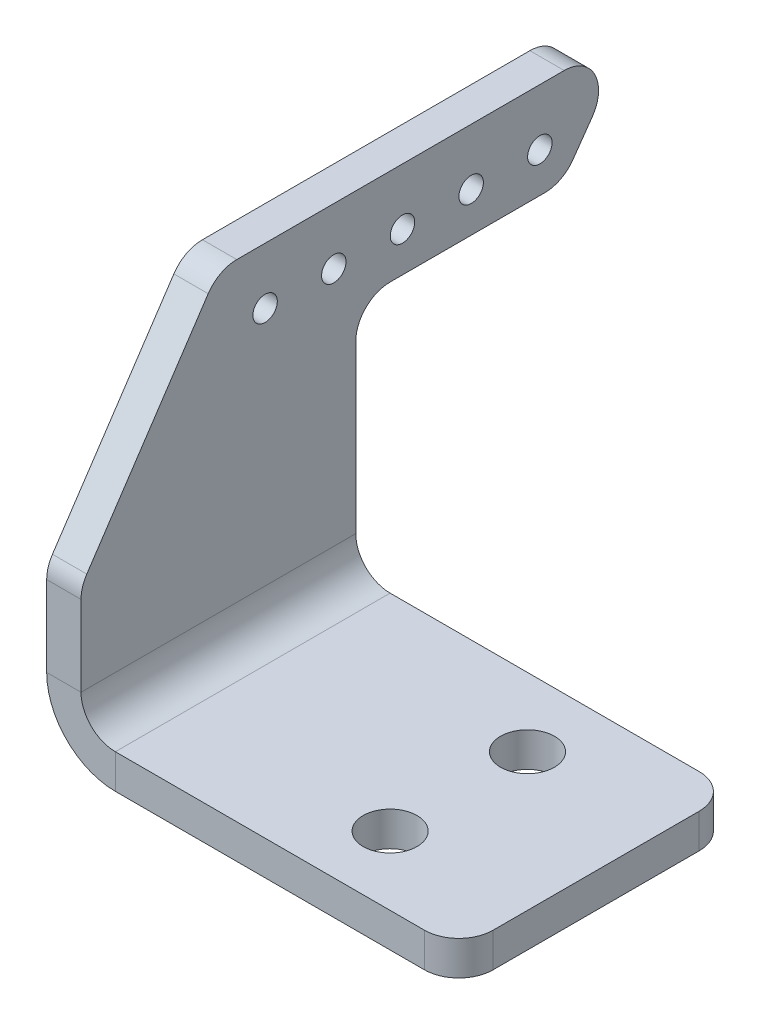
ISO-10303-21;
HEADER;
FILE_DESCRIPTION(('STEP AP214'),'2;1');
FILE_NAME('part.step','',(''),(''),'','','');
FILE_SCHEMA(('AUTOMOTIVE_DESIGN { 1 0 10303 214 1 1 1 1 }'));
ENDSEC;
DATA;
#1=APPLICATION_CONTEXT('core data for automotive mechanical design processes');
#2=APPLICATION_PROTOCOL_DEFINITION('international standard','automotive_design',2000,#1);
#3=PRODUCT_CONTEXT('',#1,'mechanical');
#4=PRODUCT('Part','Part','',(#3));
#5=PRODUCT_RELATED_PRODUCT_CATEGORY('part','',(#4));
#6=PRODUCT_DEFINITION_FORMATION('','',#4);
#7=PRODUCT_DEFINITION_CONTEXT('part definition',#1,'design');
#8=PRODUCT_DEFINITION('design','',#6,#7);
#9=PRODUCT_DEFINITION_SHAPE('','',#8);
#10=(LENGTH_UNIT() NAMED_UNIT(*) SI_UNIT(.MILLI.,.METRE.));
#11=(NAMED_UNIT(*) PLANE_ANGLE_UNIT() SI_UNIT($,.RADIAN.));
#12=(NAMED_UNIT(*) SI_UNIT($,.STERADIAN.) SOLID_ANGLE_UNIT());
#13=UNCERTAINTY_MEASURE_WITH_UNIT(LENGTH_MEASURE(1.E-05),#10,'distance_accuracy_value','');
#14=(GEOMETRIC_REPRESENTATION_CONTEXT(3) GLOBAL_UNCERTAINTY_ASSIGNED_CONTEXT((#13)) GLOBAL_UNIT_ASSIGNED_CONTEXT((#10,
#11,#12)) REPRESENTATION_CONTEXT('',''));
#15=CARTESIAN_POINT('',(0.,0.,0.));
#16=DIRECTION('',(0.,0.,1.));
#17=DIRECTION('',(1.,0.,0.));
#18=AXIS2_PLACEMENT_3D('',#15,#16,#17);
#19=CARTESIAN_POINT('',(0.,2.04408249363928,0.));
#20=DIRECTION('',(0.,0.,-1.));
#21=DIRECTION('',(0.,1.,0.));
#22=AXIS2_PLACEMENT_3D('',#19,#20,#21);
#23=PLANE('',#22);
#24=DIRECTION('',(0.,1.,0.));
#25=VECTOR('',#24,1.);
#26=CARTESIAN_POINT('',(0.,2.04408249363928,0.));
#27=LINE('',#26,#25);
#28=CARTESIAN_POINT('',(0.,6.35000000000001,0.));
#29=VERTEX_POINT('',#28);
#30=CARTESIAN_POINT('',(0.,13.7827698438402,0.));
#31=VERTEX_POINT('',#30);
#32=EDGE_CURVE('E201',#29,#31,#27,.T.);
#33=ORIENTED_EDGE('',*,*,#32,.T.);
#34=DIRECTION('',(-1.,0.,0.));
#35=VECTOR('',#34,1.);
#36=CARTESIAN_POINT('',(0.,13.7827698438402,0.));
#37=LINE('',#36,#35);
#38=CARTESIAN_POINT('',(-3.17499999999999,13.7827698438402,0.));
#39=VERTEX_POINT('',#38);
#40=EDGE_CURVE('E273',#31,#39,#37,.T.);
#41=ORIENTED_EDGE('',*,*,#40,.T.);
#42=DIRECTION('',(0.,-1.,0.));
#43=VECTOR('',#42,1.);
#44=CARTESIAN_POINT('',(-3.17500000000003,2.04408249363929,0.));
#45=LINE('',#44,#43);
#46=CARTESIAN_POINT('',(-3.17500000000002,6.35000000000002,0.));
#47=VERTEX_POINT('',#46);
#48=EDGE_CURVE('E213',#47,#39,#45,.F.);
#49=ORIENTED_EDGE('',*,*,#48,.F.);
#50=DIRECTION('',(1.,0.,0.));
#51=VECTOR('',#50,1.);
#52=CARTESIAN_POINT('',(0.,6.35000000000001,0.));
#53=LINE('',#52,#51);
#54=EDGE_CURVE('E187',#47,#29,#53,.T.);
#55=ORIENTED_EDGE('',*,*,#54,.T.);
#56=EDGE_LOOP('',(#33,#41,#49,#55));
#57=FACE_BOUND('',#56,.T.);
#58=ADVANCED_FACE('F50',(#57),#23,.F.);
#59=CARTESIAN_POINT('',(0.,2.04408249363928,-25.4));
#60=DIRECTION('',(0.,0.,1.));
#61=DIRECTION('',(0.,-1.,0.));
#62=AXIS2_PLACEMENT_3D('',#59,#60,#61);
#63=PLANE('',#62);
#64=DIRECTION('',(0.,-1.,0.));
#65=VECTOR('',#64,1.);
#66=CARTESIAN_POINT('',(-3.17500000000004,2.04408249363929,-25.4));
#67=LINE('',#66,#65);
#68=CARTESIAN_POINT('',(-3.17499999999997,21.7290824936393,-25.4));
#69=VERTEX_POINT('',#68);
#70=CARTESIAN_POINT('',(-3.17500000000002,6.35000000000002,-25.4));
#71=VERTEX_POINT('',#70);
#72=EDGE_CURVE('E226',#69,#71,#67,.T.);
#73=ORIENTED_EDGE('',*,*,#72,.F.);
#74=DIRECTION('',(1.,0.,0.));
#75=VECTOR('',#74,1.);
#76=CARTESIAN_POINT('',(0.,21.7290824936393,-25.4));
#77=LINE('',#76,#75);
#78=CARTESIAN_POINT('',(0.,21.7290824936393,-25.4));
#79=VERTEX_POINT('',#78);
#80=EDGE_CURVE('E285',#69,#79,#77,.T.);
#81=ORIENTED_EDGE('',*,*,#80,.T.);
#82=DIRECTION('',(0.,-1.,0.));
#83=VECTOR('',#82,1.);
#84=CARTESIAN_POINT('',(0.,2.04408249363928,-25.4));
#85=LINE('',#84,#83);
#86=CARTESIAN_POINT('',(0.,6.35000000000001,-25.4));
#87=VERTEX_POINT('',#86);
#88=EDGE_CURVE('E188',#79,#87,#85,.T.);
#89=ORIENTED_EDGE('',*,*,#88,.T.);
#90=DIRECTION('',(-1.,0.,0.));
#91=VECTOR('',#90,1.);
#92=CARTESIAN_POINT('',(0.,6.35000000000001,-25.4));
#93=LINE('',#92,#91);
#94=EDGE_CURVE('E218',#87,#71,#93,.T.);
#95=ORIENTED_EDGE('',*,*,#94,.T.);
#96=EDGE_LOOP('',(#73,#81,#89,#95));
#97=FACE_BOUND('',#96,.T.);
#98=ADVANCED_FACE('F299',(#97),#63,.F.);
#99=CARTESIAN_POINT('',(0.,2.04408249363928,0.));
#100=DIRECTION('',(1.,0.,0.));
#101=DIRECTION('',(0.,0.,1.));
#102=AXIS2_PLACEMENT_3D('',#99,#100,#101);
#103=PLANE('',#102);
#104=DIRECTION('',(0.,0.,1.));
#105=VECTOR('',#104,1.);
#106=CARTESIAN_POINT('',(0.,24.9040824936393,-47.8071131225593));
#107=LINE('',#106,#105);
#108=CARTESIAN_POINT('',(0.,24.9040824936393,-42.8795605736339));
#109=VERTEX_POINT('',#108);
#110=CARTESIAN_POINT('',(0.,24.9040824936393,-28.575));
#111=VERTEX_POINT('',#110);
#112=EDGE_CURVE('E288',#109,#111,#107,.T.);
#113=ORIENTED_EDGE('',*,*,#112,.F.);
#114=CARTESIAN_POINT('',(0.,28.0790824936393,-42.8795605736339));
#115=DIRECTION('',(1.,0.,0.));
#116=DIRECTION('',(0.,1.,0.));
#117=AXIS2_PLACEMENT_3D('',#114,#115,#116);
#118=CIRCLE('',#117,3.175);
#119=CARTESIAN_POINT('',(0.,26.2481133412635,-45.4734335394995));
#120=VERTEX_POINT('',#119);
#121=EDGE_CURVE('E280',#109,#120,#118,.T.);
#122=ORIENTED_EDGE('',*,*,#121,.T.);
#123=DIRECTION('',(0.,0.816967863264761,-0.576683197598656));
#124=VECTOR('',#123,1.);
#125=CARTESIAN_POINT('',(0.,-11.3305133493168,-18.9473441108545));
#126=LINE('',#125,#124);
#127=CARTESIAN_POINT('',(0.,28.7881133412635,-47.2663747159701));
#128=VERTEX_POINT('',#127);
#129=EDGE_CURVE('E228',#120,#128,#126,.T.);
#130=ORIENTED_EDGE('',*,*,#129,.T.);
#131=CARTESIAN_POINT('',(0.,30.6190824936393,-44.6725017501045));
#132=DIRECTION('',(1.,0.,0.));
#133=DIRECTION('',(0.,1.,0.));
#134=AXIS2_PLACEMENT_3D('',#131,#132,#133);
#135=CIRCLE('',#134,3.175);
#136=CARTESIAN_POINT('',(0.,33.7940824936393,-44.6725017501045));
#137=VERTEX_POINT('',#136);
#138=EDGE_CURVE('E251',#128,#137,#135,.T.);
#139=ORIENTED_EDGE('',*,*,#138,.T.);
#140=DIRECTION('',(0.,0.,-1.));
#141=VECTOR('',#140,1.);
#142=CARTESIAN_POINT('',(0.,33.7940824936393,0.));
#143=LINE('',#142,#141);
#144=CARTESIAN_POINT('',(0.,33.7940824936393,-14.3992084331994));
#145=VERTEX_POINT('',#144);
#146=EDGE_CURVE('E354',#145,#137,#143,.T.);
#147=ORIENTED_EDGE('',*,*,#146,.F.);
#148=CARTESIAN_POINT('',(0.,30.6190824936393,-14.3992084331994));
#149=DIRECTION('',(1.,0.,0.));
#150=DIRECTION('',(0.,1.,0.));
#151=AXIS2_PLACEMENT_3D('',#148,#149,#150);
#152=CIRCLE('',#151,3.175);
#153=CARTESIAN_POINT('',(0.,32.3802556166544,-11.7574487486767));
#154=VERTEX_POINT('',#153);
#155=EDGE_CURVE('E249',#145,#154,#152,.T.);
#156=ORIENTED_EDGE('',*,*,#155,.T.);
#157=DIRECTION('',(0.,0.832050294337844,-0.554700196225229));
#158=VECTOR('',#157,1.);
#159=CARTESIAN_POINT('',(0.,5.95177480133159,5.86153846153846));
#160=LINE('',#159,#158);
#161=CARTESIAN_POINT('',(0.,15.5439429668553,-0.533240315477347));
#162=VERTEX_POINT('',#161);
#163=EDGE_CURVE('E209',#162,#154,#160,.T.);
#164=ORIENTED_EDGE('',*,*,#163,.F.);
#165=CARTESIAN_POINT('',(0.,13.7827698438402,-3.175));
#166=DIRECTION('',(1.,0.,0.));
#167=DIRECTION('',(0.,1.,0.));
#168=AXIS2_PLACEMENT_3D('',#165,#166,#167);
#169=CIRCLE('',#168,3.175);
#170=EDGE_CURVE('E206',#162,#31,#169,.T.);
#171=ORIENTED_EDGE('',*,*,#170,.T.);
#172=ORIENTED_EDGE('',*,*,#32,.F.);
#173=DIRECTION('',(0.,0.,-1.));
#174=VECTOR('',#173,1.);
#175=CARTESIAN_POINT('',(0.,6.35000000000001,0.));
#176=LINE('',#175,#174);
#177=EDGE_CURVE('E176',#29,#87,#176,.T.);
#178=ORIENTED_EDGE('',*,*,#177,.T.);
#179=ORIENTED_EDGE('',*,*,#88,.F.);
#180=CARTESIAN_POINT('',(0.,21.7290824936393,-28.575));
#181=DIRECTION('',(1.,0.,0.));
#182=DIRECTION('',(0.,1.,0.));
#183=AXIS2_PLACEMENT_3D('',#180,#181,#182);
#184=CIRCLE('',#183,3.175);
#185=EDGE_CURVE('E58',#79,#111,#184,.F.);
#186=ORIENTED_EDGE('',*,*,#185,.T.);
#187=EDGE_LOOP('',(#113,#122,#130,#139,#147,#156,#164,#171,#172,#178,#179,#186));
#188=FACE_BOUND('',#187,.T.);
#189=CARTESIAN_POINT('',(0.,28.5750000000003,-42.418));
#190=DIRECTION('',(1.,0.,0.));
#191=DIRECTION('',(0.,1.,0.));
#192=AXIS2_PLACEMENT_3D('',#189,#190,#191);
#193=CIRCLE('',#192,1.1303);
#194=CARTESIAN_POINT('',(0.,29.7053000000003,-42.418));
#195=VERTEX_POINT('',#194);
#196=EDGE_CURVE('E478',#195,#195,#193,.T.);
#197=ORIENTED_EDGE('',*,*,#196,.F.);
#198=EDGE_LOOP('',(#197));
#199=FACE_BOUND('',#198,.T.);
#200=CARTESIAN_POINT('',(0.,28.5750000000003,-36.068));
#201=DIRECTION('',(1.,0.,0.));
#202=DIRECTION('',(0.,1.,0.));
#203=AXIS2_PLACEMENT_3D('',#200,#201,#202);
#204=CIRCLE('',#203,1.1303);
#205=CARTESIAN_POINT('',(0.,29.7053000000003,-36.068));
#206=VERTEX_POINT('',#205);
#207=EDGE_CURVE('E481',#206,#206,#204,.T.);
#208=ORIENTED_EDGE('',*,*,#207,.F.);
#209=EDGE_LOOP('',(#208));
#210=FACE_BOUND('',#209,.T.);
#211=CARTESIAN_POINT('',(0.,28.5750000000002,-29.718));
#212=DIRECTION('',(1.,0.,0.));
#213=DIRECTION('',(0.,1.,0.));
#214=AXIS2_PLACEMENT_3D('',#211,#212,#213);
#215=CIRCLE('',#214,1.1303);
#216=CARTESIAN_POINT('',(0.,29.7053000000002,-29.718));
#217=VERTEX_POINT('',#216);
#218=EDGE_CURVE('E487',#217,#217,#215,.T.);
#219=ORIENTED_EDGE('',*,*,#218,.F.);
#220=EDGE_LOOP('',(#219));
#221=FACE_BOUND('',#220,.T.);
#222=CARTESIAN_POINT('',(0.,28.5750000000002,-23.368));
#223=DIRECTION('',(1.,0.,0.));
#224=DIRECTION('',(0.,1.,0.));
#225=AXIS2_PLACEMENT_3D('',#222,#223,#224);
#226=CIRCLE('',#225,1.1303);
#227=CARTESIAN_POINT('',(1.0052360941894E-13,29.7053000000002,-23.368));
#228=VERTEX_POINT('',#227);
#229=EDGE_CURVE('E493',#228,#228,#226,.T.);
#230=ORIENTED_EDGE('',*,*,#229,.F.);
#231=EDGE_LOOP('',(#230));
#232=FACE_BOUND('',#231,.T.);
#233=CARTESIAN_POINT('',(0.,28.5750000000001,-17.018));
#234=DIRECTION('',(1.,0.,0.));
#235=DIRECTION('',(0.,1.,0.));
#236=AXIS2_PLACEMENT_3D('',#233,#234,#235);
#237=CIRCLE('',#236,1.1303);
#238=CARTESIAN_POINT('',(1.01390971156928E-13,29.7053000000001,-17.018));
#239=VERTEX_POINT('',#238);
#240=EDGE_CURVE('E473',#239,#239,#237,.T.);
#241=ORIENTED_EDGE('',*,*,#240,.F.);
#242=EDGE_LOOP('',(#241));
#243=FACE_BOUND('',#242,.T.);
#244=ADVANCED_FACE('F203',(#188,#199,#210,#221,#232,#243),#103,.T.);
#245=CARTESIAN_POINT('',(0.,33.7940824936393,0.));
#246=DIRECTION('',(0.,-1.,0.));
#247=DIRECTION('',(0.,0.,-1.));
#248=AXIS2_PLACEMENT_3D('',#245,#246,#247);
#249=PLANE('',#248);
#250=ORIENTED_EDGE('',*,*,#146,.T.);
#251=DIRECTION('',(1.,0.,0.));
#252=VECTOR('',#251,1.);
#253=CARTESIAN_POINT('',(0.,33.7940824936393,-44.6725017501045));
#254=LINE('',#253,#252);
#255=CARTESIAN_POINT('',(-3.17499999999993,33.7940824936393,-44.6725017501045));
#256=VERTEX_POINT('',#255);
#257=EDGE_CURVE('E266',#137,#256,#254,.F.);
#258=ORIENTED_EDGE('',*,*,#257,.T.);
#259=DIRECTION('',(0.,0.,1.));
#260=VECTOR('',#259,1.);
#261=CARTESIAN_POINT('',(-3.17499999999992,33.7940824936393,0.));
#262=LINE('',#261,#260);
#263=CARTESIAN_POINT('',(-3.17499999999993,33.7940824936393,-14.3992084331994));
#264=VERTEX_POINT('',#263);
#265=EDGE_CURVE('E361',#264,#256,#262,.F.);
#266=ORIENTED_EDGE('',*,*,#265,.F.);
#267=DIRECTION('',(-1.,0.,0.));
#268=VECTOR('',#267,1.);
#269=CARTESIAN_POINT('',(0.,33.7940824936393,-14.3992084331994));
#270=LINE('',#269,#268);
#271=EDGE_CURVE('E263',#264,#145,#270,.F.);
#272=ORIENTED_EDGE('',*,*,#271,.T.);
#273=EDGE_LOOP('',(#250,#258,#266,#272));
#274=FACE_BOUND('',#273,.T.);
#275=ADVANCED_FACE('F374',(#274),#249,.F.);
#276=CARTESIAN_POINT('',(0.,5.95177480133159,5.86153846153846));
#277=DIRECTION('',(0.,-0.554700196225229,-0.832050294337844));
#278=DIRECTION('',(0.,0.832050294337844,-0.554700196225229));
#279=AXIS2_PLACEMENT_3D('',#276,#277,#278);
#280=PLANE('',#279);
#281=ORIENTED_EDGE('',*,*,#163,.T.);
#282=DIRECTION('',(-1.,0.,0.));
#283=VECTOR('',#282,1.);
#284=CARTESIAN_POINT('',(0.,32.3802556166544,-11.7574487486767));
#285=LINE('',#284,#283);
#286=CARTESIAN_POINT('',(-3.17499999999993,32.3802556166544,-11.7574487486767));
#287=VERTEX_POINT('',#286);
#288=EDGE_CURVE('E271',#154,#287,#285,.T.);
#289=ORIENTED_EDGE('',*,*,#288,.T.);
#290=DIRECTION('',(0.,0.832050294337844,-0.554700196225229));
#291=VECTOR('',#290,1.);
#292=CARTESIAN_POINT('',(-3.17500000000002,5.9517748013316,5.86153846153846));
#293=LINE('',#292,#291);
#294=CARTESIAN_POINT('',(-3.17499999999999,15.5439429668553,-0.533240315477348));
#295=VERTEX_POINT('',#294);
#296=EDGE_CURVE('E229',#295,#287,#293,.T.);
#297=ORIENTED_EDGE('',*,*,#296,.F.);
#298=DIRECTION('',(-1.,0.,0.));
#299=VECTOR('',#298,1.);
#300=CARTESIAN_POINT('',(0.,15.5439429668553,-0.533240315477346));
#301=LINE('',#300,#299);
#302=EDGE_CURVE('E268',#295,#162,#301,.F.);
#303=ORIENTED_EDGE('',*,*,#302,.T.);
#304=EDGE_LOOP('',(#281,#289,#297,#303));
#305=FACE_BOUND('',#304,.T.);
#306=ADVANCED_FACE('F381',(#305),#280,.F.);
#307=CARTESIAN_POINT('',(0.,-11.3305133493168,-18.9473441108545));
#308=DIRECTION('',(0.,-0.576683197598656,-0.816967863264761));
#309=DIRECTION('',(0.,0.816967863264761,-0.576683197598656));
#310=AXIS2_PLACEMENT_3D('',#307,#308,#309);
#311=PLANE('',#310);
#312=ORIENTED_EDGE('',*,*,#129,.F.);
#313=DIRECTION('',(1.,0.,0.));
#314=VECTOR('',#313,1.);
#315=CARTESIAN_POINT('',(-3.17500000000008,26.2481133412636,-45.4734335394995));
#316=LINE('',#315,#314);
#317=CARTESIAN_POINT('',(-3.17499999999996,26.2481133412636,-45.4734335394995));
#318=VERTEX_POINT('',#317);
#319=EDGE_CURVE('E71',#120,#318,#316,.F.);
#320=ORIENTED_EDGE('',*,*,#319,.T.);
#321=DIRECTION('',(0.,0.816967863264761,-0.576683197598656));
#322=VECTOR('',#321,1.);
#323=CARTESIAN_POINT('',(-3.17500000000008,-11.3305133493168,-18.9473441108544));
#324=LINE('',#323,#322);
#325=CARTESIAN_POINT('',(-3.17499999999995,28.7881133412636,-47.2663747159701));
#326=VERTEX_POINT('',#325);
#327=EDGE_CURVE('E320',#318,#326,#324,.T.);
#328=ORIENTED_EDGE('',*,*,#327,.T.);
#329=DIRECTION('',(-1.,0.,0.));
#330=VECTOR('',#329,1.);
#331=CARTESIAN_POINT('',(0.,28.7881133412635,-47.2663747159701));
#332=LINE('',#331,#330);
#333=EDGE_CURVE('E253',#326,#128,#332,.F.);
#334=ORIENTED_EDGE('',*,*,#333,.T.);
#335=EDGE_LOOP('',(#312,#320,#328,#334));
#336=FACE_BOUND('',#335,.T.);
#337=ADVANCED_FACE('F363',(#336),#311,.T.);
#338=CARTESIAN_POINT('',(-3.17500000000003,2.04408249363929,0.));
#339=DIRECTION('',(1.,0.,0.));
#340=DIRECTION('',(0.,0.,1.));
#341=AXIS2_PLACEMENT_3D('',#338,#339,#340);
#342=PLANE('',#341);
#343=CARTESIAN_POINT('',(-3.17500000000005,28.5750000000003,-42.418));
#344=DIRECTION('',(1.,0.,0.));
#345=DIRECTION('',(0.,1.,0.));
#346=AXIS2_PLACEMENT_3D('',#343,#344,#345);
#347=CIRCLE('',#346,1.1303);
#348=CARTESIAN_POINT('',(-3.17500000000004,29.7053000000003,-42.418));
#349=VERTEX_POINT('',#348);
#350=EDGE_CURVE('E313',#349,#349,#347,.T.);
#351=ORIENTED_EDGE('',*,*,#350,.T.);
#352=EDGE_LOOP('',(#351));
#353=FACE_BOUND('',#352,.T.);
#354=CARTESIAN_POINT('',(-3.17500000000005,28.5750000000003,-36.068));
#355=DIRECTION('',(1.,0.,0.));
#356=DIRECTION('',(0.,1.,0.));
#357=AXIS2_PLACEMENT_3D('',#354,#355,#356);
#358=CIRCLE('',#357,1.1303);
#359=CARTESIAN_POINT('',(-3.17500000000004,29.7053000000003,-36.068));
#360=VERTEX_POINT('',#359);
#361=EDGE_CURVE('E484',#360,#360,#358,.T.);
#362=ORIENTED_EDGE('',*,*,#361,.T.);
#363=EDGE_LOOP('',(#362));
#364=FACE_BOUND('',#363,.T.);
#365=CARTESIAN_POINT('',(-3.17500000000005,28.5750000000002,-29.718));
#366=DIRECTION('',(1.,0.,0.));
#367=DIRECTION('',(0.,1.,0.));
#368=AXIS2_PLACEMENT_3D('',#365,#366,#367);
#369=CIRCLE('',#368,1.1303);
#370=CARTESIAN_POINT('',(-3.17500000000004,29.7053000000002,-29.718));
#371=VERTEX_POINT('',#370);
#372=EDGE_CURVE('E490',#371,#371,#369,.T.);
#373=ORIENTED_EDGE('',*,*,#372,.T.);
#374=EDGE_LOOP('',(#373));
#375=FACE_BOUND('',#374,.T.);
#376=CARTESIAN_POINT('',(-3.17500000000004,28.5750000000002,-23.368));
#377=DIRECTION('',(1.,0.,0.));
#378=DIRECTION('',(0.,1.,0.));
#379=AXIS2_PLACEMENT_3D('',#376,#377,#378);
#380=CIRCLE('',#379,1.1303);
#381=CARTESIAN_POINT('',(-3.17500000000004,29.7053000000002,-23.368));
#382=VERTEX_POINT('',#381);
#383=EDGE_CURVE('E496',#382,#382,#380,.T.);
#384=ORIENTED_EDGE('',*,*,#383,.T.);
#385=EDGE_LOOP('',(#384));
#386=FACE_BOUND('',#385,.T.);
#387=CARTESIAN_POINT('',(-3.17500000000004,28.5750000000001,-17.018));
#388=DIRECTION('',(1.,0.,0.));
#389=DIRECTION('',(0.,1.,0.));
#390=AXIS2_PLACEMENT_3D('',#387,#388,#389);
#391=CIRCLE('',#390,1.1303);
#392=CARTESIAN_POINT('',(-3.17500000000004,29.7053000000001,-17.018));
#393=VERTEX_POINT('',#392);
#394=EDGE_CURVE('E470',#393,#393,#391,.T.);
#395=ORIENTED_EDGE('',*,*,#394,.T.);
#396=EDGE_LOOP('',(#395));
#397=FACE_BOUND('',#396,.T.);
#398=ORIENTED_EDGE('',*,*,#327,.F.);
#399=CARTESIAN_POINT('',(-3.17499999999995,28.0790824936393,-42.8795605736339));
#400=DIRECTION('',(1.,0.,0.));
#401=DIRECTION('',(0.,1.,0.));
#402=AXIS2_PLACEMENT_3D('',#399,#400,#401);
#403=CIRCLE('',#402,3.175);
#404=CARTESIAN_POINT('',(-3.17500000000008,24.9040824936393,-42.8795605736339));
#405=VERTEX_POINT('',#404);
#406=EDGE_CURVE('E283',#318,#405,#403,.F.);
#407=ORIENTED_EDGE('',*,*,#406,.T.);
#408=DIRECTION('',(0.,0.,1.));
#409=VECTOR('',#408,1.);
#410=CARTESIAN_POINT('',(-3.17500000000008,24.9040824936393,-47.8071131225593));
#411=LINE('',#410,#409);
#412=CARTESIAN_POINT('',(-3.17500000000008,24.9040824936393,-28.575));
#413=VERTEX_POINT('',#412);
#414=EDGE_CURVE('E296',#405,#413,#411,.T.);
#415=ORIENTED_EDGE('',*,*,#414,.T.);
#416=CARTESIAN_POINT('',(-3.17499999999997,21.7290824936393,-28.575));
#417=DIRECTION('',(1.,0.,0.));
#418=DIRECTION('',(0.,1.,0.));
#419=AXIS2_PLACEMENT_3D('',#416,#417,#418);
#420=CIRCLE('',#419,3.175);
#421=EDGE_CURVE('E12',#413,#69,#420,.T.);
#422=ORIENTED_EDGE('',*,*,#421,.T.);
#423=ORIENTED_EDGE('',*,*,#72,.T.);
#424=DIRECTION('',(0.,0.,-1.));
#425=VECTOR('',#424,1.);
#426=CARTESIAN_POINT('',(-3.17500000000002,6.35000000000002,0.));
#427=LINE('',#426,#425);
#428=EDGE_CURVE('E215',#47,#71,#427,.T.);
#429=ORIENTED_EDGE('',*,*,#428,.F.);
#430=ORIENTED_EDGE('',*,*,#48,.T.);
#431=CARTESIAN_POINT('',(-3.17499999999999,13.7827698438402,-3.175));
#432=DIRECTION('',(1.,0.,0.));
#433=DIRECTION('',(0.,1.,0.));
#434=AXIS2_PLACEMENT_3D('',#431,#432,#433);
#435=CIRCLE('',#434,3.175);
#436=EDGE_CURVE('E256',#39,#295,#435,.F.);
#437=ORIENTED_EDGE('',*,*,#436,.T.);
#438=ORIENTED_EDGE('',*,*,#296,.T.);
#439=CARTESIAN_POINT('',(-3.17499999999994,30.6190824936393,-14.3992084331994));
#440=DIRECTION('',(1.,0.,0.));
#441=DIRECTION('',(0.,1.,0.));
#442=AXIS2_PLACEMENT_3D('',#439,#440,#441);
#443=CIRCLE('',#442,3.175);
#444=EDGE_CURVE('E258',#287,#264,#443,.F.);
#445=ORIENTED_EDGE('',*,*,#444,.T.);
#446=ORIENTED_EDGE('',*,*,#265,.T.);
#447=CARTESIAN_POINT('',(-3.17499999999994,30.6190824936393,-44.6725017501045));
#448=DIRECTION('',(1.,0.,0.));
#449=DIRECTION('',(0.,1.,0.));
#450=AXIS2_PLACEMENT_3D('',#447,#448,#449);
#451=CIRCLE('',#450,3.175);
#452=EDGE_CURVE('E260',#256,#326,#451,.F.);
#453=ORIENTED_EDGE('',*,*,#452,.T.);
#454=EDGE_LOOP('',(#398,#407,#415,#422,#423,#429,#430,#437,#438,#445,#446,#453));
#455=FACE_BOUND('',#454,.T.);
#456=ADVANCED_FACE('F300',(#353,#364,#375,#386,#397,#455),#342,.F.);
#457=CARTESIAN_POINT('',(22.225,3.175,-6.35));
#458=DIRECTION('',(0.,1.,0.));
#459=DIRECTION('',(0.,0.,1.));
#460=AXIS2_PLACEMENT_3D('',#457,#458,#459);
#461=CYLINDRICAL_SURFACE('',#460,2.4892);
#462=CARTESIAN_POINT('',(22.225,3.175,-6.35));
#463=DIRECTION('',(0.,1.,0.));
#464=DIRECTION('',(0.,0.,1.));
#465=AXIS2_PLACEMENT_3D('',#462,#463,#464);
#466=CIRCLE('',#465,2.4892);
#467=CARTESIAN_POINT('',(22.225,3.175,-3.8608));
#468=VERTEX_POINT('',#467);
#469=EDGE_CURVE('E346',#468,#468,#466,.T.);
#470=ORIENTED_EDGE('',*,*,#469,.T.);
#471=EDGE_LOOP('',(#470));
#472=FACE_BOUND('',#471,.T.);
#473=CARTESIAN_POINT('',(22.225,0.,-6.35));
#474=DIRECTION('',(0.,1.,0.));
#475=DIRECTION('',(0.,0.,1.));
#476=AXIS2_PLACEMENT_3D('',#473,#474,#475);
#477=CIRCLE('',#476,2.4892);
#478=CARTESIAN_POINT('',(22.225,0.,-3.8608));
#479=VERTEX_POINT('',#478);
#480=EDGE_CURVE('E329',#479,#479,#477,.T.);
#481=ORIENTED_EDGE('',*,*,#480,.F.);
#482=EDGE_LOOP('',(#481));
#483=FACE_BOUND('',#482,.T.);
#484=ADVANCED_FACE('F408',(#472,#483),#461,.F.);
#485=CARTESIAN_POINT('',(22.225,3.175,-19.05));
#486=DIRECTION('',(0.,1.,0.));
#487=DIRECTION('',(0.,0.,1.));
#488=AXIS2_PLACEMENT_3D('',#485,#486,#487);
#489=CYLINDRICAL_SURFACE('',#488,2.4892);
#490=CARTESIAN_POINT('',(22.225,3.175,-19.05));
#491=DIRECTION('',(0.,1.,0.));
#492=DIRECTION('',(0.,0.,1.));
#493=AXIS2_PLACEMENT_3D('',#490,#491,#492);
#494=CIRCLE('',#493,2.4892);
#495=CARTESIAN_POINT('',(22.225,3.175,-16.5608));
#496=VERTEX_POINT('',#495);
#497=EDGE_CURVE('E343',#496,#496,#494,.T.);
#498=ORIENTED_EDGE('',*,*,#497,.T.);
#499=EDGE_LOOP('',(#498));
#500=FACE_BOUND('',#499,.T.);
#501=CARTESIAN_POINT('',(22.225,0.,-19.05));
#502=DIRECTION('',(0.,1.,0.));
#503=DIRECTION('',(0.,0.,1.));
#504=AXIS2_PLACEMENT_3D('',#501,#502,#503);
#505=CIRCLE('',#504,2.4892);
#506=CARTESIAN_POINT('',(22.225,0.,-16.5608));
#507=VERTEX_POINT('',#506);
#508=EDGE_CURVE('E332',#507,#507,#505,.T.);
#509=ORIENTED_EDGE('',*,*,#508,.F.);
#510=EDGE_LOOP('',(#509));
#511=FACE_BOUND('',#510,.T.);
#512=ADVANCED_FACE('F672',(#500,#511),#489,.F.);
#513=CARTESIAN_POINT('',(34.925,3.175,0.));
#514=DIRECTION('',(1.,0.,0.));
#515=DIRECTION('',(0.,0.,-1.));
#516=AXIS2_PLACEMENT_3D('',#513,#514,#515);
#517=PLANE('',#516);
#518=DIRECTION('',(0.,0.,1.));
#519=VECTOR('',#518,1.);
#520=CARTESIAN_POINT('',(34.925,0.,0.));
#521=LINE('',#520,#519);
#522=CARTESIAN_POINT('',(34.925,0.,-3.175));
#523=VERTEX_POINT('',#522);
#524=CARTESIAN_POINT('',(34.925,0.,-22.225));
#525=VERTEX_POINT('',#524);
#526=EDGE_CURVE('E340',#523,#525,#521,.F.);
#527=ORIENTED_EDGE('',*,*,#526,.T.);
#528=DIRECTION('',(0.,-1.,0.));
#529=VECTOR('',#528,1.);
#530=CARTESIAN_POINT('',(34.925,3.175,-22.225));
#531=LINE('',#530,#529);
#532=CARTESIAN_POINT('',(34.925,3.175,-22.225));
#533=VERTEX_POINT('',#532);
#534=EDGE_CURVE('E232',#525,#533,#531,.F.);
#535=ORIENTED_EDGE('',*,*,#534,.T.);
#536=DIRECTION('',(0.,0.,-1.));
#537=VECTOR('',#536,1.);
#538=CARTESIAN_POINT('',(34.925,3.175,0.));
#539=LINE('',#538,#537);
#540=CARTESIAN_POINT('',(34.925,3.175,-3.175));
#541=VERTEX_POINT('',#540);
#542=EDGE_CURVE('E337',#541,#533,#539,.T.);
#543=ORIENTED_EDGE('',*,*,#542,.F.);
#544=DIRECTION('',(0.,-1.,0.));
#545=VECTOR('',#544,1.);
#546=CARTESIAN_POINT('',(34.925,3.175,-3.175));
#547=LINE('',#546,#545);
#548=EDGE_CURVE('E224',#541,#523,#547,.T.);
#549=ORIENTED_EDGE('',*,*,#548,.T.);
#550=EDGE_LOOP('',(#527,#535,#543,#549));
#551=FACE_BOUND('',#550,.T.);
#552=ADVANCED_FACE('F663',(#551),#517,.T.);
#553=CARTESIAN_POINT('',(0.,3.175,0.));
#554=DIRECTION('',(0.,1.,0.));
#555=DIRECTION('',(0.,0.,1.));
#556=AXIS2_PLACEMENT_3D('',#553,#554,#555);
#557=PLANE('',#556);
#558=ORIENTED_EDGE('',*,*,#542,.T.);
#559=CARTESIAN_POINT('',(31.75,3.175,-22.225));
#560=DIRECTION('',(0.,1.,0.));
#561=DIRECTION('',(0.,0.,1.));
#562=AXIS2_PLACEMENT_3D('',#559,#560,#561);
#563=CIRCLE('',#562,3.175);
#564=CARTESIAN_POINT('',(31.75,3.175,-25.4));
#565=VERTEX_POINT('',#564);
#566=EDGE_CURVE('E237',#533,#565,#563,.T.);
#567=ORIENTED_EDGE('',*,*,#566,.T.);
#568=DIRECTION('',(1.,0.,0.));
#569=VECTOR('',#568,1.);
#570=CARTESIAN_POINT('',(0.,3.175,-25.4));
#571=LINE('',#570,#569);
#572=CARTESIAN_POINT('',(3.17499999999998,3.175,-25.4));
#573=VERTEX_POINT('',#572);
#574=EDGE_CURVE('E317',#573,#565,#571,.T.);
#575=ORIENTED_EDGE('',*,*,#574,.F.);
#576=DIRECTION('',(0.,0.,-1.));
#577=VECTOR('',#576,1.);
#578=CARTESIAN_POINT('',(3.17499999999998,3.175,0.));
#579=LINE('',#578,#577);
#580=CARTESIAN_POINT('',(3.17499999999998,3.175,0.));
#581=VERTEX_POINT('',#580);
#582=EDGE_CURVE('E351',#581,#573,#579,.T.);
#583=ORIENTED_EDGE('',*,*,#582,.F.);
#584=DIRECTION('',(-1.,0.,0.));
#585=VECTOR('',#584,1.);
#586=CARTESIAN_POINT('',(0.,3.175,0.));
#587=LINE('',#586,#585);
#588=CARTESIAN_POINT('',(31.75,3.175,0.));
#589=VERTEX_POINT('',#588);
#590=EDGE_CURVE('E335',#589,#581,#587,.T.);
#591=ORIENTED_EDGE('',*,*,#590,.F.);
#592=CARTESIAN_POINT('',(31.75,3.175,-3.175));
#593=DIRECTION('',(0.,1.,0.));
#594=DIRECTION('',(0.,0.,1.));
#595=AXIS2_PLACEMENT_3D('',#592,#593,#594);
#596=CIRCLE('',#595,3.175);
#597=EDGE_CURVE('E235',#589,#541,#596,.T.);
#598=ORIENTED_EDGE('',*,*,#597,.T.);
#599=EDGE_LOOP('',(#558,#567,#575,#583,#591,#598));
#600=FACE_BOUND('',#599,.T.);
#601=ORIENTED_EDGE('',*,*,#497,.F.);
#602=EDGE_LOOP('',(#601));
#603=FACE_BOUND('',#602,.T.);
#604=ORIENTED_EDGE('',*,*,#469,.F.);
#605=EDGE_LOOP('',(#604));
#606=FACE_BOUND('',#605,.T.);
#607=ADVANCED_FACE('F654',(#600,#603,#606),#557,.T.);
#608=CARTESIAN_POINT('',(0.,3.175,0.));
#609=DIRECTION('',(0.,0.,-1.));
#610=DIRECTION('',(-1.,0.,0.));
#611=AXIS2_PLACEMENT_3D('',#608,#609,#610);
#612=PLANE('',#611);
#613=DIRECTION('',(1.,0.,0.));
#614=VECTOR('',#613,1.);
#615=CARTESIAN_POINT('',(0.,0.,0.));
#616=LINE('',#615,#614);
#617=CARTESIAN_POINT('',(31.75,0.,0.));
#618=VERTEX_POINT('',#617);
#619=CARTESIAN_POINT('',(3.17499999999998,0.,0.));
#620=VERTEX_POINT('',#619);
#621=EDGE_CURVE('E327',#618,#620,#616,.F.);
#622=ORIENTED_EDGE('',*,*,#621,.F.);
#623=DIRECTION('',(0.,1.,0.));
#624=VECTOR('',#623,1.);
#625=CARTESIAN_POINT('',(31.75,3.175,0.));
#626=LINE('',#625,#624);
#627=EDGE_CURVE('E245',#618,#589,#626,.T.);
#628=ORIENTED_EDGE('',*,*,#627,.T.);
#629=ORIENTED_EDGE('',*,*,#590,.T.);
#630=DIRECTION('',(0.,1.,0.));
#631=VECTOR('',#630,1.);
#632=CARTESIAN_POINT('',(3.17499999999998,3.175,0.));
#633=LINE('',#632,#631);
#634=EDGE_CURVE('E197',#620,#581,#633,.T.);
#635=ORIENTED_EDGE('',*,*,#634,.F.);
#636=EDGE_LOOP('',(#622,#628,#629,#635));
#637=FACE_BOUND('',#636,.T.);
#638=ADVANCED_FACE('F645',(#637),#612,.F.);
#639=CARTESIAN_POINT('',(0.,0.,0.));
#640=DIRECTION('',(0.,1.,0.));
#641=DIRECTION('',(0.,0.,1.));
#642=AXIS2_PLACEMENT_3D('',#639,#640,#641);
#643=PLANE('',#642);
#644=ORIENTED_EDGE('',*,*,#508,.T.);
#645=EDGE_LOOP('',(#644));
#646=FACE_BOUND('',#645,.T.);
#647=ORIENTED_EDGE('',*,*,#480,.T.);
#648=EDGE_LOOP('',(#647));
#649=FACE_BOUND('',#648,.T.);
#650=DIRECTION('',(1.,0.,0.));
#651=VECTOR('',#650,1.);
#652=CARTESIAN_POINT('',(0.,0.,-25.4));
#653=LINE('',#652,#651);
#654=CARTESIAN_POINT('',(3.17499999999998,0.,-25.4));
#655=VERTEX_POINT('',#654);
#656=CARTESIAN_POINT('',(31.75,0.,-25.4));
#657=VERTEX_POINT('',#656);
#658=EDGE_CURVE('E321',#655,#657,#653,.T.);
#659=ORIENTED_EDGE('',*,*,#658,.T.);
#660=CARTESIAN_POINT('',(31.75,0.,-22.225));
#661=DIRECTION('',(0.,1.,0.));
#662=DIRECTION('',(0.,0.,1.));
#663=AXIS2_PLACEMENT_3D('',#660,#661,#662);
#664=CIRCLE('',#663,3.175);
#665=EDGE_CURVE('E243',#657,#525,#664,.F.);
#666=ORIENTED_EDGE('',*,*,#665,.T.);
#667=ORIENTED_EDGE('',*,*,#526,.F.);
#668=CARTESIAN_POINT('',(31.75,0.,-3.175));
#669=DIRECTION('',(0.,1.,0.));
#670=DIRECTION('',(0.,0.,1.));
#671=AXIS2_PLACEMENT_3D('',#668,#669,#670);
#672=CIRCLE('',#671,3.175);
#673=EDGE_CURVE('E241',#523,#618,#672,.F.);
#674=ORIENTED_EDGE('',*,*,#673,.T.);
#675=ORIENTED_EDGE('',*,*,#621,.T.);
#676=DIRECTION('',(0.,0.,-1.));
#677=VECTOR('',#676,1.);
#678=CARTESIAN_POINT('',(3.17499999999998,0.,0.));
#679=LINE('',#678,#677);
#680=EDGE_CURVE('E324',#620,#655,#679,.T.);
#681=ORIENTED_EDGE('',*,*,#680,.T.);
#682=EDGE_LOOP('',(#659,#666,#667,#674,#675,#681));
#683=FACE_BOUND('',#682,.T.);
#684=ADVANCED_FACE('F637',(#646,#649,#683),#643,.F.);
#685=CARTESIAN_POINT('',(0.,3.175,-25.4));
#686=DIRECTION('',(0.,0.,1.));
#687=DIRECTION('',(1.,0.,0.));
#688=AXIS2_PLACEMENT_3D('',#685,#686,#687);
#689=PLANE('',#688);
#690=ORIENTED_EDGE('',*,*,#574,.T.);
#691=DIRECTION('',(0.,1.,0.));
#692=VECTOR('',#691,1.);
#693=CARTESIAN_POINT('',(31.75,3.175,-25.4));
#694=LINE('',#693,#692);
#695=EDGE_CURVE('E239',#565,#657,#694,.F.);
#696=ORIENTED_EDGE('',*,*,#695,.T.);
#697=ORIENTED_EDGE('',*,*,#658,.F.);
#698=DIRECTION('',(0.,-1.,0.));
#699=VECTOR('',#698,1.);
#700=CARTESIAN_POINT('',(3.17499999999998,3.175,-25.4));
#701=LINE('',#700,#699);
#702=EDGE_CURVE('E311',#573,#655,#701,.T.);
#703=ORIENTED_EDGE('',*,*,#702,.F.);
#704=EDGE_LOOP('',(#690,#696,#697,#703));
#705=FACE_BOUND('',#704,.T.);
#706=ADVANCED_FACE('F537',(#705),#689,.F.);
#707=CARTESIAN_POINT('',(3.17499999999998,6.35,0.));
#708=DIRECTION('',(0.,0.,-1.));
#709=DIRECTION('',(-1.,0.,0.));
#710=AXIS2_PLACEMENT_3D('',#707,#708,#709);
#711=PLANE('',#710);
#712=ORIENTED_EDGE('',*,*,#54,.F.);
#713=CARTESIAN_POINT('',(3.17499999999998,6.35,0.));
#714=DIRECTION('',(0.,0.,1.));
#715=DIRECTION('',(1.,0.,0.));
#716=AXIS2_PLACEMENT_3D('',#713,#714,#715);
#717=CIRCLE('',#716,6.35);
#718=EDGE_CURVE('E306',#47,#620,#717,.T.);
#719=ORIENTED_EDGE('',*,*,#718,.T.);
#720=ORIENTED_EDGE('',*,*,#634,.T.);
#721=CARTESIAN_POINT('',(3.17499999999998,6.35,0.));
#722=DIRECTION('',(0.,0.,1.));
#723=DIRECTION('',(-1.,0.,0.));
#724=AXIS2_PLACEMENT_3D('',#721,#722,#723);
#725=CIRCLE('',#724,3.175);
#726=EDGE_CURVE('E180',#29,#581,#725,.T.);
#727=ORIENTED_EDGE('',*,*,#726,.F.);
#728=EDGE_LOOP('',(#712,#719,#720,#727));
#729=FACE_BOUND('',#728,.T.);
#730=ADVANCED_FACE('F192',(#729),#711,.F.);
#731=CARTESIAN_POINT('',(3.17499999999998,6.35,-25.4));
#732=DIRECTION('',(0.,0.,1.));
#733=DIRECTION('',(1.,0.,0.));
#734=AXIS2_PLACEMENT_3D('',#731,#732,#733);
#735=PLANE('',#734);
#736=CARTESIAN_POINT('',(3.17499999999998,6.35,-25.4));
#737=DIRECTION('',(0.,0.,1.));
#738=DIRECTION('',(1.,0.,0.));
#739=AXIS2_PLACEMENT_3D('',#736,#737,#738);
#740=CIRCLE('',#739,6.35);
#741=EDGE_CURVE('E198',#655,#71,#740,.F.);
#742=ORIENTED_EDGE('',*,*,#741,.T.);
#743=ORIENTED_EDGE('',*,*,#94,.F.);
#744=CARTESIAN_POINT('',(3.17499999999998,6.35,-25.4));
#745=DIRECTION('',(0.,0.,-1.));
#746=DIRECTION('',(1.,0.,0.));
#747=AXIS2_PLACEMENT_3D('',#744,#745,#746);
#748=CIRCLE('',#747,3.175);
#749=EDGE_CURVE('E182',#573,#87,#748,.T.);
#750=ORIENTED_EDGE('',*,*,#749,.F.);
#751=ORIENTED_EDGE('',*,*,#702,.T.);
#752=EDGE_LOOP('',(#742,#743,#750,#751));
#753=FACE_BOUND('',#752,.T.);
#754=ADVANCED_FACE('F309',(#753),#735,.F.);
#755=CARTESIAN_POINT('',(3.17499999999997,6.35,-39.3684223706048));
#756=DIRECTION('',(0.,0.,1.));
#757=DIRECTION('',(1.,0.,0.));
#758=AXIS2_PLACEMENT_3D('',#755,#756,#757);
#759=CYLINDRICAL_SURFACE('',#758,3.175);
#760=ORIENTED_EDGE('',*,*,#582,.T.);
#761=ORIENTED_EDGE('',*,*,#749,.T.);
#762=ORIENTED_EDGE('',*,*,#177,.F.);
#763=ORIENTED_EDGE('',*,*,#726,.T.);
#764=EDGE_LOOP('',(#760,#761,#762,#763));
#765=FACE_BOUND('',#764,.T.);
#766=ADVANCED_FACE('F179',(#765),#759,.F.);
#767=CARTESIAN_POINT('',(3.17499999999997,6.35,-39.3684223706048));
#768=DIRECTION('',(0.,0.,1.));
#769=DIRECTION('',(1.,0.,0.));
#770=AXIS2_PLACEMENT_3D('',#767,#768,#769);
#771=CYLINDRICAL_SURFACE('',#770,6.35);
#772=ORIENTED_EDGE('',*,*,#680,.F.);
#773=ORIENTED_EDGE('',*,*,#718,.F.);
#774=ORIENTED_EDGE('',*,*,#428,.T.);
#775=ORIENTED_EDGE('',*,*,#741,.F.);
#776=EDGE_LOOP('',(#772,#773,#774,#775));
#777=FACE_BOUND('',#776,.T.);
#778=ADVANCED_FACE('F305',(#777),#771,.T.);
#779=CARTESIAN_POINT('',(-3.17500000000004,28.5750000000001,-17.018));
#780=DIRECTION('',(1.,0.,0.));
#781=DIRECTION('',(0.,1.,0.));
#782=AXIS2_PLACEMENT_3D('',#779,#780,#781);
#783=CYLINDRICAL_SURFACE('',#782,1.1303);
#784=ORIENTED_EDGE('',*,*,#394,.F.);
#785=EDGE_LOOP('',(#784));
#786=FACE_BOUND('',#785,.T.);
#787=ORIENTED_EDGE('',*,*,#240,.T.);
#788=EDGE_LOOP('',(#787));
#789=FACE_BOUND('',#788,.T.);
#790=ADVANCED_FACE('F502',(#786,#789),#783,.F.);
#791=CARTESIAN_POINT('',(-3.17500000000004,28.5750000000002,-23.368));
#792=DIRECTION('',(1.,0.,0.));
#793=DIRECTION('',(0.,1.,0.));
#794=AXIS2_PLACEMENT_3D('',#791,#792,#793);
#795=CYLINDRICAL_SURFACE('',#794,1.1303);
#796=ORIENTED_EDGE('',*,*,#383,.F.);
#797=EDGE_LOOP('',(#796));
#798=FACE_BOUND('',#797,.T.);
#799=ORIENTED_EDGE('',*,*,#229,.T.);
#800=EDGE_LOOP('',(#799));
#801=FACE_BOUND('',#800,.T.);
#802=ADVANCED_FACE('F576',(#798,#801),#795,.F.);
#803=CARTESIAN_POINT('',(-3.17500000000005,28.5750000000002,-29.718));
#804=DIRECTION('',(1.,0.,0.));
#805=DIRECTION('',(0.,1.,0.));
#806=AXIS2_PLACEMENT_3D('',#803,#804,#805);
#807=CYLINDRICAL_SURFACE('',#806,1.1303);
#808=ORIENTED_EDGE('',*,*,#372,.F.);
#809=EDGE_LOOP('',(#808));
#810=FACE_BOUND('',#809,.T.);
#811=ORIENTED_EDGE('',*,*,#218,.T.);
#812=EDGE_LOOP('',(#811));
#813=FACE_BOUND('',#812,.T.);
#814=ADVANCED_FACE('F587',(#810,#813),#807,.F.);
#815=CARTESIAN_POINT('',(-3.17500000000005,28.5750000000003,-36.068));
#816=DIRECTION('',(1.,0.,0.));
#817=DIRECTION('',(0.,1.,0.));
#818=AXIS2_PLACEMENT_3D('',#815,#816,#817);
#819=CYLINDRICAL_SURFACE('',#818,1.1303);
#820=ORIENTED_EDGE('',*,*,#361,.F.);
#821=EDGE_LOOP('',(#820));
#822=FACE_BOUND('',#821,.T.);
#823=ORIENTED_EDGE('',*,*,#207,.T.);
#824=EDGE_LOOP('',(#823));
#825=FACE_BOUND('',#824,.T.);
#826=ADVANCED_FACE('F598',(#822,#825),#819,.F.);
#827=CARTESIAN_POINT('',(-3.17500000000005,28.5750000000003,-42.418));
#828=DIRECTION('',(1.,0.,0.));
#829=DIRECTION('',(0.,1.,0.));
#830=AXIS2_PLACEMENT_3D('',#827,#828,#829);
#831=CYLINDRICAL_SURFACE('',#830,1.1303);
#832=ORIENTED_EDGE('',*,*,#350,.F.);
#833=EDGE_LOOP('',(#832));
#834=FACE_BOUND('',#833,.T.);
#835=ORIENTED_EDGE('',*,*,#196,.T.);
#836=EDGE_LOOP('',(#835));
#837=FACE_BOUND('',#836,.T.);
#838=ADVANCED_FACE('F415',(#834,#837),#831,.F.);
#839=CARTESIAN_POINT('',(31.75,3.175,-22.225));
#840=DIRECTION('',(0.,-1.,0.));
#841=DIRECTION('',(0.,0.,-1.));
#842=AXIS2_PLACEMENT_3D('',#839,#840,#841);
#843=CYLINDRICAL_SURFACE('',#842,3.175);
#844=ORIENTED_EDGE('',*,*,#665,.F.);
#845=ORIENTED_EDGE('',*,*,#695,.F.);
#846=ORIENTED_EDGE('',*,*,#566,.F.);
#847=ORIENTED_EDGE('',*,*,#534,.F.);
#848=EDGE_LOOP('',(#844,#845,#846,#847));
#849=FACE_BOUND('',#848,.T.);
#850=ADVANCED_FACE('F411',(#849),#843,.T.);
#851=CARTESIAN_POINT('',(31.75,3.175,-3.175));
#852=DIRECTION('',(0.,-1.,0.));
#853=DIRECTION('',(0.,0.,-1.));
#854=AXIS2_PLACEMENT_3D('',#851,#852,#853);
#855=CYLINDRICAL_SURFACE('',#854,3.175);
#856=ORIENTED_EDGE('',*,*,#673,.F.);
#857=ORIENTED_EDGE('',*,*,#548,.F.);
#858=ORIENTED_EDGE('',*,*,#597,.F.);
#859=ORIENTED_EDGE('',*,*,#627,.F.);
#860=EDGE_LOOP('',(#856,#857,#858,#859));
#861=FACE_BOUND('',#860,.T.);
#862=ADVANCED_FACE('F414',(#861),#855,.T.);
#863=CARTESIAN_POINT('',(0.,30.6190824936393,-44.6725017501045));
#864=DIRECTION('',(-1.,0.,0.));
#865=DIRECTION('',(0.,-1.,0.));
#866=AXIS2_PLACEMENT_3D('',#863,#864,#865);
#867=CYLINDRICAL_SURFACE('',#866,3.175);
#868=ORIENTED_EDGE('',*,*,#452,.F.);
#869=ORIENTED_EDGE('',*,*,#257,.F.);
#870=ORIENTED_EDGE('',*,*,#138,.F.);
#871=ORIENTED_EDGE('',*,*,#333,.F.);
#872=EDGE_LOOP('',(#868,#869,#870,#871));
#873=FACE_BOUND('',#872,.T.);
#874=ADVANCED_FACE('F371',(#873),#867,.T.);
#875=CARTESIAN_POINT('',(0.,30.6190824936393,-14.3992084331994));
#876=DIRECTION('',(1.,0.,0.));
#877=DIRECTION('',(0.,1.,0.));
#878=AXIS2_PLACEMENT_3D('',#875,#876,#877);
#879=CYLINDRICAL_SURFACE('',#878,3.175);
#880=ORIENTED_EDGE('',*,*,#444,.F.);
#881=ORIENTED_EDGE('',*,*,#288,.F.);
#882=ORIENTED_EDGE('',*,*,#155,.F.);
#883=ORIENTED_EDGE('',*,*,#271,.F.);
#884=EDGE_LOOP('',(#880,#881,#882,#883));
#885=FACE_BOUND('',#884,.T.);
#886=ADVANCED_FACE('F378',(#885),#879,.T.);
#887=CARTESIAN_POINT('',(0.,13.7827698438402,-3.175));
#888=DIRECTION('',(1.,0.,0.));
#889=DIRECTION('',(0.,1.,0.));
#890=AXIS2_PLACEMENT_3D('',#887,#888,#889);
#891=CYLINDRICAL_SURFACE('',#890,3.175);
#892=ORIENTED_EDGE('',*,*,#436,.F.);
#893=ORIENTED_EDGE('',*,*,#40,.F.);
#894=ORIENTED_EDGE('',*,*,#170,.F.);
#895=ORIENTED_EDGE('',*,*,#302,.F.);
#896=EDGE_LOOP('',(#892,#893,#894,#895));
#897=FACE_BOUND('',#896,.T.);
#898=ADVANCED_FACE('F386',(#897),#891,.T.);
#899=CARTESIAN_POINT('',(-3.17500000000008,24.9040824936393,-47.8071131225593));
#900=DIRECTION('',(0.,1.,0.));
#901=DIRECTION('',(-1.,0.,0.));
#902=AXIS2_PLACEMENT_3D('',#899,#900,#901);
#903=PLANE('',#902);
#904=ORIENTED_EDGE('',*,*,#414,.F.);
#905=DIRECTION('',(1.,0.,0.));
#906=VECTOR('',#905,1.);
#907=CARTESIAN_POINT('',(0.,24.9040824936393,-42.8795605736339));
#908=LINE('',#907,#906);
#909=EDGE_CURVE('E277',#405,#109,#908,.T.);
#910=ORIENTED_EDGE('',*,*,#909,.T.);
#911=ORIENTED_EDGE('',*,*,#112,.T.);
#912=DIRECTION('',(-1.,0.,0.));
#913=VECTOR('',#912,1.);
#914=CARTESIAN_POINT('',(-3.17500000000008,24.9040824936393,-28.575));
#915=LINE('',#914,#913);
#916=EDGE_CURVE('E275',#111,#413,#915,.T.);
#917=ORIENTED_EDGE('',*,*,#916,.T.);
#918=EDGE_LOOP('',(#904,#910,#911,#917));
#919=FACE_BOUND('',#918,.T.);
#920=ADVANCED_FACE('F294',(#919),#903,.F.);
#921=CARTESIAN_POINT('',(-3.17500000000007,28.0790824936393,-42.8795605736339));
#922=DIRECTION('',(-1.,0.,0.));
#923=DIRECTION('',(0.,-1.,0.));
#924=AXIS2_PLACEMENT_3D('',#921,#922,#923);
#925=CYLINDRICAL_SURFACE('',#924,3.175);
#926=ORIENTED_EDGE('',*,*,#406,.F.);
#927=ORIENTED_EDGE('',*,*,#319,.F.);
#928=ORIENTED_EDGE('',*,*,#121,.F.);
#929=ORIENTED_EDGE('',*,*,#909,.F.);
#930=EDGE_LOOP('',(#926,#927,#928,#929));
#931=FACE_BOUND('',#930,.T.);
#932=ADVANCED_FACE('F394',(#931),#925,.T.);
#933=CARTESIAN_POINT('',(0.,21.7290824936393,-28.575));
#934=DIRECTION('',(-1.,0.,0.));
#935=DIRECTION('',(0.,-1.,0.));
#936=AXIS2_PLACEMENT_3D('',#933,#934,#935);
#937=CYLINDRICAL_SURFACE('',#936,3.175);
#938=ORIENTED_EDGE('',*,*,#421,.F.);
#939=ORIENTED_EDGE('',*,*,#916,.F.);
#940=ORIENTED_EDGE('',*,*,#185,.F.);
#941=ORIENTED_EDGE('',*,*,#80,.F.);
#942=EDGE_LOOP('',(#938,#939,#940,#941));
#943=FACE_BOUND('',#942,.T.);
#944=ADVANCED_FACE('F52',(#943),#937,.F.);
#945=CLOSED_SHELL('',(#58,#98,#244,#275,#306,#337,#456,#484,#512,#552,#607,#638,#684,#706,#730,
#754,#766,#778,#790,#802,#814,#826,#838,#850,#862,#874,#886,#898,#920,#932,#944));
#946=MANIFOLD_SOLID_BREP('B2',#945);
#947=ADVANCED_BREP_SHAPE_REPRESENTATION('',(#18,#946),#14);
#948=SHAPE_DEFINITION_REPRESENTATION(#9,#947);
ENDSEC;
END-ISO-10303-21;
